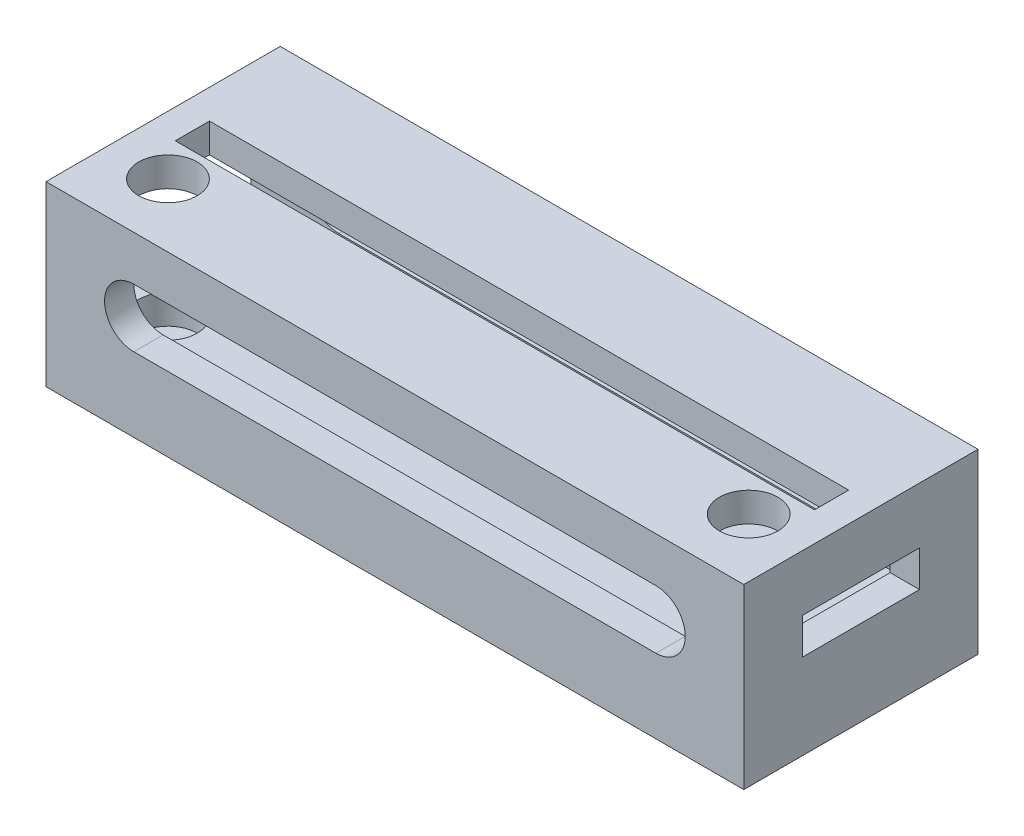
ISO-10303-21;
HEADER;
FILE_DESCRIPTION(('STEP AP214'),'2;1');
FILE_NAME('part.step','',(''),(''),'','','');
FILE_SCHEMA(('AUTOMOTIVE_DESIGN { 1 0 10303 214 1 1 1 1 }'));
ENDSEC;
DATA;
#1=APPLICATION_CONTEXT('core data for automotive mechanical design processes');
#2=APPLICATION_PROTOCOL_DEFINITION('international standard','automotive_design',2000,#1);
#3=PRODUCT_CONTEXT('',#1,'mechanical');
#4=PRODUCT('Part','Part','',(#3));
#5=PRODUCT_RELATED_PRODUCT_CATEGORY('part','',(#4));
#6=PRODUCT_DEFINITION_FORMATION('','',#4);
#7=PRODUCT_DEFINITION_CONTEXT('part definition',#1,'design');
#8=PRODUCT_DEFINITION('design','',#6,#7);
#9=PRODUCT_DEFINITION_SHAPE('','',#8);
#10=(LENGTH_UNIT() NAMED_UNIT(*) SI_UNIT(.MILLI.,.METRE.));
#11=(NAMED_UNIT(*) PLANE_ANGLE_UNIT() SI_UNIT($,.RADIAN.));
#12=(NAMED_UNIT(*) SI_UNIT($,.STERADIAN.) SOLID_ANGLE_UNIT());
#13=UNCERTAINTY_MEASURE_WITH_UNIT(LENGTH_MEASURE(1.E-05),#10,'distance_accuracy_value','');
#14=(GEOMETRIC_REPRESENTATION_CONTEXT(3) GLOBAL_UNCERTAINTY_ASSIGNED_CONTEXT((#13)) GLOBAL_UNIT_ASSIGNED_CONTEXT((#10,
#11,#12)) REPRESENTATION_CONTEXT('',''));
#15=CARTESIAN_POINT('',(0.,0.,0.));
#16=DIRECTION('',(0.,0.,1.));
#17=DIRECTION('',(1.,0.,0.));
#18=AXIS2_PLACEMENT_3D('',#15,#16,#17);
#19=CARTESIAN_POINT('',(0.,6.,0.));
#20=DIRECTION('',(0.,-1.,0.));
#21=DIRECTION('',(0.,0.,-1.));
#22=AXIS2_PLACEMENT_3D('',#19,#20,#21);
#23=PLANE('',#22);
#24=CARTESIAN_POINT('',(-29.75,6.,0.));
#25=DIRECTION('',(0.,-1.,0.));
#26=DIRECTION('',(0.,0.,-1.));
#27=AXIS2_PLACEMENT_3D('',#24,#25,#26);
#28=CIRCLE('',#27,3.);
#29=CARTESIAN_POINT('',(-29.75,6.,-3.));
#30=VERTEX_POINT('',#29);
#31=EDGE_CURVE('E235',#30,#30,#28,.T.);
#32=ORIENTED_EDGE('',*,*,#31,.T.);
#33=EDGE_LOOP('',(#32));
#34=FACE_BOUND('',#33,.T.);
#35=DIRECTION('',(0.,0.,-1.));
#36=VECTOR('',#35,1.);
#37=CARTESIAN_POINT('',(32.75,6.,4.5));
#38=LINE('',#37,#36);
#39=CARTESIAN_POINT('',(32.75,6.,3.5));
#40=VERTEX_POINT('',#39);
#41=CARTESIAN_POINT('',(32.75,6.,0.));
#42=VERTEX_POINT('',#41);
#43=EDGE_CURVE('E13',#40,#42,#38,.T.);
#44=ORIENTED_EDGE('',*,*,#43,.T.);
#45=CARTESIAN_POINT('',(29.75,6.,0.));
#46=DIRECTION('',(0.,-1.,0.));
#47=DIRECTION('',(0.,0.,-1.));
#48=AXIS2_PLACEMENT_3D('',#45,#46,#47);
#49=CIRCLE('',#48,3.);
#50=EDGE_CURVE('E53',#42,#42,#49,.T.);
#51=ORIENTED_EDGE('',*,*,#50,.T.);
#52=CARTESIAN_POINT('',(32.75,6.,-14.5));
#53=VERTEX_POINT('',#52);
#54=EDGE_CURVE('E47',#42,#53,#38,.T.);
#55=ORIENTED_EDGE('',*,*,#54,.T.);
#56=DIRECTION('',(1.,0.,0.));
#57=VECTOR('',#56,1.);
#58=CARTESIAN_POINT('',(32.75,6.,-14.5));
#59=LINE('',#58,#57);
#60=CARTESIAN_POINT('',(-35.75,6.,-14.5));
#61=VERTEX_POINT('',#60);
#62=EDGE_CURVE('E397',#61,#53,#59,.T.);
#63=ORIENTED_EDGE('',*,*,#62,.F.);
#64=DIRECTION('',(0.,0.,1.));
#65=VECTOR('',#64,1.);
#66=CARTESIAN_POINT('',(-35.75,6.,-14.5));
#67=LINE('',#66,#65);
#68=CARTESIAN_POINT('',(-35.75,6.,3.5));
#69=VERTEX_POINT('',#68);
#70=EDGE_CURVE('E267',#61,#69,#67,.T.);
#71=ORIENTED_EDGE('',*,*,#70,.T.);
#72=DIRECTION('',(-1.,0.,0.));
#73=VECTOR('',#72,1.);
#74=CARTESIAN_POINT('',(32.75,6.,3.5));
#75=LINE('',#74,#73);
#76=EDGE_CURVE('E387',#40,#69,#75,.T.);
#77=ORIENTED_EDGE('',*,*,#76,.F.);
#78=EDGE_LOOP('',(#44,#51,#55,#63,#71,#77));
#79=FACE_BOUND('',#78,.T.);
#80=ADVANCED_FACE('F38',(#34,#79),#23,.F.);
#81=CARTESIAN_POINT('',(0.,0.,0.));
#82=DIRECTION('',(0.,-1.,0.));
#83=DIRECTION('',(0.,0.,-1.));
#84=AXIS2_PLACEMENT_3D('',#81,#82,#83);
#85=PLANE('',#84);
#86=CARTESIAN_POINT('',(-29.75,0.,0.));
#87=DIRECTION('',(0.,1.,0.));
#88=DIRECTION('',(0.,0.,1.));
#89=AXIS2_PLACEMENT_3D('',#86,#87,#88);
#90=CIRCLE('',#89,0.99839537848789);
#91=CARTESIAN_POINT('',(-29.75,0.,0.99839537848789));
#92=VERTEX_POINT('',#91);
#93=EDGE_CURVE('E403',#92,#92,#90,.T.);
#94=ORIENTED_EDGE('',*,*,#93,.T.);
#95=EDGE_LOOP('',(#94));
#96=FACE_BOUND('',#95,.T.);
#97=DIRECTION('',(-1.,0.,0.));
#98=VECTOR('',#97,1.);
#99=CARTESIAN_POINT('',(32.75,0.,-17.5));
#100=LINE('',#99,#98);
#101=CARTESIAN_POINT('',(35.75,0.,-17.5));
#102=VERTEX_POINT('',#101);
#103=CARTESIAN_POINT('',(-35.75,0.,-17.5));
#104=VERTEX_POINT('',#103);
#105=EDGE_CURVE('E372',#102,#104,#100,.T.);
#106=ORIENTED_EDGE('',*,*,#105,.F.);
#107=DIRECTION('',(0.,0.,-1.));
#108=VECTOR('',#107,1.);
#109=CARTESIAN_POINT('',(35.75,0.,0.));
#110=LINE('',#109,#108);
#111=CARTESIAN_POINT('',(35.75,0.,6.5));
#112=VERTEX_POINT('',#111);
#113=EDGE_CURVE('E335',#112,#102,#110,.T.);
#114=ORIENTED_EDGE('',*,*,#113,.F.);
#115=DIRECTION('',(1.,0.,0.));
#116=VECTOR('',#115,1.);
#117=CARTESIAN_POINT('',(-32.75,0.,6.5));
#118=LINE('',#117,#116);
#119=CARTESIAN_POINT('',(-35.75,0.,6.5));
#120=VERTEX_POINT('',#119);
#121=EDGE_CURVE('E395',#120,#112,#118,.T.);
#122=ORIENTED_EDGE('',*,*,#121,.F.);
#123=DIRECTION('',(0.,0.,1.));
#124=VECTOR('',#123,1.);
#125=CARTESIAN_POINT('',(-35.75,0.,6.5));
#126=LINE('',#125,#124);
#127=EDGE_CURVE('E384',#104,#120,#126,.T.);
#128=ORIENTED_EDGE('',*,*,#127,.F.);
#129=EDGE_LOOP('',(#106,#114,#122,#128));
#130=FACE_BOUND('',#129,.T.);
#131=CARTESIAN_POINT('',(29.75,0.,0.));
#132=DIRECTION('',(0.,1.,0.));
#133=DIRECTION('',(0.,0.,1.));
#134=AXIS2_PLACEMENT_3D('',#131,#132,#133);
#135=CIRCLE('',#134,1.24311598076932);
#136=CARTESIAN_POINT('',(29.75,0.,1.24311598076932));
#137=VERTEX_POINT('',#136);
#138=EDGE_CURVE('E400',#137,#137,#135,.T.);
#139=ORIENTED_EDGE('',*,*,#138,.T.);
#140=EDGE_LOOP('',(#139));
#141=FACE_BOUND('',#140,.T.);
#142=ADVANCED_FACE('F40',(#96,#130,#141),#85,.T.);
#143=CARTESIAN_POINT('',(-29.75,6.,0.));
#144=DIRECTION('',(0.,-1.,0.));
#145=DIRECTION('',(0.,0.,-1.));
#146=AXIS2_PLACEMENT_3D('',#143,#144,#145);
#147=CYLINDRICAL_SURFACE('',#146,0.99839537848789);
#148=CARTESIAN_POINT('',(-29.75,3.,0.));
#149=DIRECTION('',(0.,-1.,0.));
#150=DIRECTION('',(0.,0.,-1.));
#151=AXIS2_PLACEMENT_3D('',#148,#149,#150);
#152=CIRCLE('',#151,0.99839537848789);
#153=CARTESIAN_POINT('',(-29.75,3.,-0.99839537848789));
#154=VERTEX_POINT('',#153);
#155=EDGE_CURVE('E42',#154,#154,#152,.T.);
#156=ORIENTED_EDGE('',*,*,#155,.F.);
#157=EDGE_LOOP('',(#156));
#158=FACE_BOUND('',#157,.T.);
#159=ORIENTED_EDGE('',*,*,#93,.F.);
#160=EDGE_LOOP('',(#159));
#161=FACE_BOUND('',#160,.T.);
#162=ADVANCED_FACE('F483',(#158,#161),#147,.F.);
#163=CARTESIAN_POINT('',(29.75,6.,0.));
#164=DIRECTION('',(0.,-1.,0.));
#165=DIRECTION('',(0.,0.,-1.));
#166=AXIS2_PLACEMENT_3D('',#163,#164,#165);
#167=CYLINDRICAL_SURFACE('',#166,1.24311598076932);
#168=CARTESIAN_POINT('',(29.75,3.,0.));
#169=DIRECTION('',(0.,-1.,0.));
#170=DIRECTION('',(0.,0.,-1.));
#171=AXIS2_PLACEMENT_3D('',#168,#169,#170);
#172=CIRCLE('',#171,1.24311598076932);
#173=CARTESIAN_POINT('',(29.75,3.,-1.24311598076932));
#174=VERTEX_POINT('',#173);
#175=EDGE_CURVE('E405',#174,#174,#172,.T.);
#176=ORIENTED_EDGE('',*,*,#175,.F.);
#177=EDGE_LOOP('',(#176));
#178=FACE_BOUND('',#177,.T.);
#179=ORIENTED_EDGE('',*,*,#138,.F.);
#180=EDGE_LOOP('',(#179));
#181=FACE_BOUND('',#180,.T.);
#182=ADVANCED_FACE('F489',(#178,#181),#167,.F.);
#183=CARTESIAN_POINT('',(0.,0.,6.5));
#184=DIRECTION('',(0.,0.,1.));
#185=DIRECTION('',(1.,0.,0.));
#186=AXIS2_PLACEMENT_3D('',#183,#184,#185);
#187=PLANE('',#186);
#188=CARTESIAN_POINT('',(-26.75,10.6,6.5));
#189=DIRECTION('',(0.,0.,1.));
#190=DIRECTION('',(1.,0.,0.));
#191=AXIS2_PLACEMENT_3D('',#188,#189,#190);
#192=CIRCLE('',#191,3.);
#193=CARTESIAN_POINT('',(-26.75,13.6,6.5));
#194=VERTEX_POINT('',#193);
#195=CARTESIAN_POINT('',(-26.75,7.6,6.5));
#196=VERTEX_POINT('',#195);
#197=EDGE_CURVE('E272',#194,#196,#192,.T.);
#198=ORIENTED_EDGE('',*,*,#197,.F.);
#199=DIRECTION('',(1.,0.,0.));
#200=VECTOR('',#199,1.);
#201=CARTESIAN_POINT('',(0.,13.6,6.5));
#202=LINE('',#201,#200);
#203=CARTESIAN_POINT('',(26.75,13.6,6.5));
#204=VERTEX_POINT('',#203);
#205=EDGE_CURVE('E277',#194,#204,#202,.T.);
#206=ORIENTED_EDGE('',*,*,#205,.T.);
#207=CARTESIAN_POINT('',(26.75,10.6,6.5));
#208=DIRECTION('',(0.,0.,1.));
#209=DIRECTION('',(1.,0.,0.));
#210=AXIS2_PLACEMENT_3D('',#207,#208,#209);
#211=CIRCLE('',#210,3.);
#212=CARTESIAN_POINT('',(26.75,7.6,6.5));
#213=VERTEX_POINT('',#212);
#214=EDGE_CURVE('E289',#213,#204,#211,.T.);
#215=ORIENTED_EDGE('',*,*,#214,.F.);
#216=DIRECTION('',(-1.,0.,0.));
#217=VECTOR('',#216,1.);
#218=CARTESIAN_POINT('',(0.,7.6,6.5));
#219=LINE('',#218,#217);
#220=EDGE_CURVE('E286',#213,#196,#219,.T.);
#221=ORIENTED_EDGE('',*,*,#220,.T.);
#222=EDGE_LOOP('',(#198,#206,#215,#221));
#223=FACE_BOUND('',#222,.T.);
#224=DIRECTION('',(0.,-1.,0.));
#225=VECTOR('',#224,1.);
#226=CARTESIAN_POINT('',(35.75,0.,6.5));
#227=LINE('',#226,#225);
#228=CARTESIAN_POINT('',(35.75,18.2,6.5));
#229=VERTEX_POINT('',#228);
#230=EDGE_CURVE('E331',#229,#112,#227,.T.);
#231=ORIENTED_EDGE('',*,*,#230,.F.);
#232=DIRECTION('',(1.,0.,0.));
#233=VECTOR('',#232,1.);
#234=CARTESIAN_POINT('',(-35.75,18.2,6.5));
#235=LINE('',#234,#233);
#236=CARTESIAN_POINT('',(-35.75,18.2,6.5));
#237=VERTEX_POINT('',#236);
#238=EDGE_CURVE('E253',#237,#229,#235,.T.);
#239=ORIENTED_EDGE('',*,*,#238,.F.);
#240=DIRECTION('',(0.,1.,0.));
#241=VECTOR('',#240,1.);
#242=CARTESIAN_POINT('',(-35.75,15.2,6.5));
#243=LINE('',#242,#241);
#244=EDGE_CURVE('E378',#120,#237,#243,.T.);
#245=ORIENTED_EDGE('',*,*,#244,.F.);
#246=ORIENTED_EDGE('',*,*,#121,.T.);
#247=EDGE_LOOP('',(#231,#239,#245,#246));
#248=FACE_BOUND('',#247,.T.);
#249=ADVANCED_FACE('F454',(#223,#248),#187,.T.);
#250=CARTESIAN_POINT('',(32.75,15.2,3.5));
#251=DIRECTION('',(0.,0.,1.));
#252=DIRECTION('',(1.,0.,0.));
#253=AXIS2_PLACEMENT_3D('',#250,#251,#252);
#254=PLANE('',#253);
#255=DIRECTION('',(1.,0.,0.));
#256=VECTOR('',#255,1.);
#257=CARTESIAN_POINT('',(32.75,13.6,3.5));
#258=LINE('',#257,#256);
#259=CARTESIAN_POINT('',(-26.75,13.6,3.5));
#260=VERTEX_POINT('',#259);
#261=CARTESIAN_POINT('',(26.75,13.6,3.5));
#262=VERTEX_POINT('',#261);
#263=EDGE_CURVE('E320',#260,#262,#258,.T.);
#264=ORIENTED_EDGE('',*,*,#263,.F.);
#265=CARTESIAN_POINT('',(-26.75,10.6,3.5));
#266=DIRECTION('',(0.,0.,1.));
#267=DIRECTION('',(1.,0.,0.));
#268=AXIS2_PLACEMENT_3D('',#265,#266,#267);
#269=CIRCLE('',#268,3.);
#270=CARTESIAN_POINT('',(-26.75,7.6,3.5));
#271=VERTEX_POINT('',#270);
#272=EDGE_CURVE('E325',#260,#271,#269,.T.);
#273=ORIENTED_EDGE('',*,*,#272,.T.);
#274=DIRECTION('',(-1.,0.,0.));
#275=VECTOR('',#274,1.);
#276=CARTESIAN_POINT('',(32.75,7.6,3.5));
#277=LINE('',#276,#275);
#278=CARTESIAN_POINT('',(26.75,7.6,3.5));
#279=VERTEX_POINT('',#278);
#280=EDGE_CURVE('E310',#279,#271,#277,.T.);
#281=ORIENTED_EDGE('',*,*,#280,.F.);
#282=CARTESIAN_POINT('',(26.75,10.6,3.5));
#283=DIRECTION('',(0.,0.,1.));
#284=DIRECTION('',(1.,0.,0.));
#285=AXIS2_PLACEMENT_3D('',#282,#283,#284);
#286=CIRCLE('',#285,3.);
#287=EDGE_CURVE('E315',#279,#262,#286,.T.);
#288=ORIENTED_EDGE('',*,*,#287,.T.);
#289=EDGE_LOOP('',(#264,#273,#281,#288));
#290=FACE_BOUND('',#289,.T.);
#291=ORIENTED_EDGE('',*,*,#76,.T.);
#292=DIRECTION('',(0.,1.,0.));
#293=VECTOR('',#292,1.);
#294=CARTESIAN_POINT('',(-35.75,15.2,3.5));
#295=LINE('',#294,#293);
#296=CARTESIAN_POINT('',(-35.75,15.2,3.5));
#297=VERTEX_POINT('',#296);
#298=EDGE_CURVE('E270',#69,#297,#295,.T.);
#299=ORIENTED_EDGE('',*,*,#298,.T.);
#300=DIRECTION('',(-1.,0.,0.));
#301=VECTOR('',#300,1.);
#302=CARTESIAN_POINT('',(32.75,15.2,3.5));
#303=LINE('',#302,#301);
#304=CARTESIAN_POINT('',(32.75,15.2,3.5));
#305=VERTEX_POINT('',#304);
#306=EDGE_CURVE('E388',#305,#297,#303,.T.);
#307=ORIENTED_EDGE('',*,*,#306,.F.);
#308=DIRECTION('',(0.,-1.,0.));
#309=VECTOR('',#308,1.);
#310=CARTESIAN_POINT('',(32.75,15.2,3.5));
#311=LINE('',#310,#309);
#312=EDGE_CURVE('E391',#305,#40,#311,.T.);
#313=ORIENTED_EDGE('',*,*,#312,.T.);
#314=EDGE_LOOP('',(#291,#299,#307,#313));
#315=FACE_BOUND('',#314,.T.);
#316=ADVANCED_FACE('F496',(#290,#315),#254,.F.);
#317=CARTESIAN_POINT('',(-35.75,0.,0.));
#318=DIRECTION('',(1.,0.,0.));
#319=DIRECTION('',(0.,0.,-1.));
#320=AXIS2_PLACEMENT_3D('',#317,#318,#319);
#321=PLANE('',#320);
#322=DIRECTION('',(0.,0.,1.));
#323=VECTOR('',#322,1.);
#324=CARTESIAN_POINT('',(-35.75,18.2,-17.5));
#325=LINE('',#324,#323);
#326=CARTESIAN_POINT('',(-35.75,18.2,-17.5));
#327=VERTEX_POINT('',#326);
#328=EDGE_CURVE('E250',#327,#237,#325,.T.);
#329=ORIENTED_EDGE('',*,*,#328,.F.);
#330=DIRECTION('',(0.,1.,0.));
#331=VECTOR('',#330,1.);
#332=CARTESIAN_POINT('',(-35.75,15.2,-17.5));
#333=LINE('',#332,#331);
#334=EDGE_CURVE('E375',#104,#327,#333,.T.);
#335=ORIENTED_EDGE('',*,*,#334,.F.);
#336=ORIENTED_EDGE('',*,*,#127,.T.);
#337=ORIENTED_EDGE('',*,*,#244,.T.);
#338=EDGE_LOOP('',(#329,#335,#336,#337));
#339=FACE_BOUND('',#338,.T.);
#340=ORIENTED_EDGE('',*,*,#70,.F.);
#341=DIRECTION('',(0.,-1.,0.));
#342=VECTOR('',#341,1.);
#343=CARTESIAN_POINT('',(-35.75,15.2,-14.5));
#344=LINE('',#343,#342);
#345=CARTESIAN_POINT('',(-35.75,15.2,-14.5));
#346=VERTEX_POINT('',#345);
#347=EDGE_CURVE('E262',#346,#61,#344,.T.);
#348=ORIENTED_EDGE('',*,*,#347,.F.);
#349=DIRECTION('',(0.,0.,1.));
#350=VECTOR('',#349,1.);
#351=CARTESIAN_POINT('',(-35.75,15.2,-17.5));
#352=LINE('',#351,#350);
#353=EDGE_CURVE('E246',#346,#297,#352,.T.);
#354=ORIENTED_EDGE('',*,*,#353,.T.);
#355=ORIENTED_EDGE('',*,*,#298,.F.);
#356=EDGE_LOOP('',(#340,#348,#354,#355));
#357=FACE_BOUND('',#356,.T.);
#358=ADVANCED_FACE('F450',(#339,#357),#321,.F.);
#359=CARTESIAN_POINT('',(0.,0.,-14.5));
#360=DIRECTION('',(0.,0.,-1.));
#361=DIRECTION('',(-1.,0.,0.));
#362=AXIS2_PLACEMENT_3D('',#359,#360,#361);
#363=PLANE('',#362);
#364=DIRECTION('',(1.,0.,0.));
#365=VECTOR('',#364,1.);
#366=CARTESIAN_POINT('',(0.,7.6,-14.5));
#367=LINE('',#366,#365);
#368=CARTESIAN_POINT('',(-26.75,7.6,-14.5));
#369=VERTEX_POINT('',#368);
#370=CARTESIAN_POINT('',(26.75,7.6,-14.5));
#371=VERTEX_POINT('',#370);
#372=EDGE_CURVE('E297',#369,#371,#367,.T.);
#373=ORIENTED_EDGE('',*,*,#372,.F.);
#374=CARTESIAN_POINT('',(-26.75,10.6,-14.5));
#375=DIRECTION('',(0.,0.,-1.));
#376=DIRECTION('',(-1.,0.,0.));
#377=AXIS2_PLACEMENT_3D('',#374,#375,#376);
#378=CIRCLE('',#377,3.);
#379=CARTESIAN_POINT('',(-26.75,13.6,-14.5));
#380=VERTEX_POINT('',#379);
#381=EDGE_CURVE('E322',#369,#380,#378,.T.);
#382=ORIENTED_EDGE('',*,*,#381,.T.);
#383=DIRECTION('',(-1.,0.,0.));
#384=VECTOR('',#383,1.);
#385=CARTESIAN_POINT('',(0.,13.6,-14.5));
#386=LINE('',#385,#384);
#387=CARTESIAN_POINT('',(26.75,13.6,-14.5));
#388=VERTEX_POINT('',#387);
#389=EDGE_CURVE('E318',#388,#380,#386,.T.);
#390=ORIENTED_EDGE('',*,*,#389,.F.);
#391=CARTESIAN_POINT('',(26.75,10.6,-14.5));
#392=DIRECTION('',(0.,0.,-1.));
#393=DIRECTION('',(-1.,0.,0.));
#394=AXIS2_PLACEMENT_3D('',#391,#392,#393);
#395=CIRCLE('',#394,3.);
#396=EDGE_CURVE('E312',#388,#371,#395,.T.);
#397=ORIENTED_EDGE('',*,*,#396,.T.);
#398=EDGE_LOOP('',(#373,#382,#390,#397));
#399=FACE_BOUND('',#398,.T.);
#400=DIRECTION('',(1.,0.,0.));
#401=VECTOR('',#400,1.);
#402=CARTESIAN_POINT('',(32.75,15.2,-14.5));
#403=LINE('',#402,#401);
#404=CARTESIAN_POINT('',(32.75,15.2,-14.5));
#405=VERTEX_POINT('',#404);
#406=EDGE_CURVE('E376',#346,#405,#403,.T.);
#407=ORIENTED_EDGE('',*,*,#406,.F.);
#408=ORIENTED_EDGE('',*,*,#347,.T.);
#409=ORIENTED_EDGE('',*,*,#62,.T.);
#410=DIRECTION('',(0.,-1.,0.));
#411=VECTOR('',#410,1.);
#412=CARTESIAN_POINT('',(32.75,15.2,-14.5));
#413=LINE('',#412,#411);
#414=EDGE_CURVE('E371',#405,#53,#413,.T.);
#415=ORIENTED_EDGE('',*,*,#414,.F.);
#416=EDGE_LOOP('',(#407,#408,#409,#415));
#417=FACE_BOUND('',#416,.T.);
#418=ADVANCED_FACE('F466',(#399,#417),#363,.F.);
#419=CARTESIAN_POINT('',(0.,0.,-17.5));
#420=DIRECTION('',(0.,0.,-1.));
#421=DIRECTION('',(-1.,0.,0.));
#422=AXIS2_PLACEMENT_3D('',#419,#420,#421);
#423=PLANE('',#422);
#424=CARTESIAN_POINT('',(-26.75,10.6,-17.5));
#425=DIRECTION('',(0.,0.,1.));
#426=DIRECTION('',(1.,0.,0.));
#427=AXIS2_PLACEMENT_3D('',#424,#425,#426);
#428=CIRCLE('',#427,3.);
#429=CARTESIAN_POINT('',(-26.75,13.6,-17.5));
#430=VERTEX_POINT('',#429);
#431=CARTESIAN_POINT('',(-26.75,7.6,-17.5));
#432=VERTEX_POINT('',#431);
#433=EDGE_CURVE('E273',#430,#432,#428,.T.);
#434=ORIENTED_EDGE('',*,*,#433,.T.);
#435=DIRECTION('',(-1.,0.,0.));
#436=VECTOR('',#435,1.);
#437=CARTESIAN_POINT('',(0.,7.6,-17.5));
#438=LINE('',#437,#436);
#439=CARTESIAN_POINT('',(26.75,7.6,-17.5));
#440=VERTEX_POINT('',#439);
#441=EDGE_CURVE('E276',#440,#432,#438,.T.);
#442=ORIENTED_EDGE('',*,*,#441,.F.);
#443=CARTESIAN_POINT('',(26.75,10.6,-17.5));
#444=DIRECTION('',(0.,0.,1.));
#445=DIRECTION('',(1.,0.,0.));
#446=AXIS2_PLACEMENT_3D('',#443,#444,#445);
#447=CIRCLE('',#446,3.);
#448=CARTESIAN_POINT('',(26.75,13.6,-17.5));
#449=VERTEX_POINT('',#448);
#450=EDGE_CURVE('E279',#440,#449,#447,.T.);
#451=ORIENTED_EDGE('',*,*,#450,.T.);
#452=DIRECTION('',(1.,0.,0.));
#453=VECTOR('',#452,1.);
#454=CARTESIAN_POINT('',(0.,13.6,-17.5));
#455=LINE('',#454,#453);
#456=EDGE_CURVE('E282',#430,#449,#455,.T.);
#457=ORIENTED_EDGE('',*,*,#456,.F.);
#458=EDGE_LOOP('',(#434,#442,#451,#457));
#459=FACE_BOUND('',#458,.T.);
#460=ORIENTED_EDGE('',*,*,#334,.T.);
#461=DIRECTION('',(-1.,0.,0.));
#462=VECTOR('',#461,1.);
#463=CARTESIAN_POINT('',(-35.75,18.2,-17.5));
#464=LINE('',#463,#462);
#465=CARTESIAN_POINT('',(35.75,18.2,-17.5));
#466=VERTEX_POINT('',#465);
#467=EDGE_CURVE('E259',#466,#327,#464,.T.);
#468=ORIENTED_EDGE('',*,*,#467,.F.);
#469=DIRECTION('',(0.,1.,0.));
#470=VECTOR('',#469,1.);
#471=CARTESIAN_POINT('',(35.75,0.,-17.5));
#472=LINE('',#471,#470);
#473=EDGE_CURVE('E329',#102,#466,#472,.T.);
#474=ORIENTED_EDGE('',*,*,#473,.F.);
#475=ORIENTED_EDGE('',*,*,#105,.T.);
#476=EDGE_LOOP('',(#460,#468,#474,#475));
#477=FACE_BOUND('',#476,.T.);
#478=ADVANCED_FACE('F463',(#459,#477),#423,.T.);
#479=CARTESIAN_POINT('',(32.75,0.,0.));
#480=DIRECTION('',(1.,0.,0.));
#481=DIRECTION('',(0.,0.,-1.));
#482=AXIS2_PLACEMENT_3D('',#479,#480,#481);
#483=PLANE('',#482);
#484=DIRECTION('',(0.,-1.,0.));
#485=VECTOR('',#484,1.);
#486=CARTESIAN_POINT('',(32.75,0.,0.499999999999996));
#487=LINE('',#486,#485);
#488=CARTESIAN_POINT('',(32.75,12.45,0.499999999999997));
#489=VERTEX_POINT('',#488);
#490=CARTESIAN_POINT('',(32.75,8.75,0.499999999999997));
#491=VERTEX_POINT('',#490);
#492=EDGE_CURVE('E332',#489,#491,#487,.T.);
#493=ORIENTED_EDGE('',*,*,#492,.T.);
#494=DIRECTION('',(0.,0.,1.));
#495=VECTOR('',#494,1.);
#496=CARTESIAN_POINT('',(32.75,8.75,0.));
#497=LINE('',#496,#495);
#498=CARTESIAN_POINT('',(32.75,8.75,-11.5));
#499=VERTEX_POINT('',#498);
#500=EDGE_CURVE('E357',#499,#491,#497,.T.);
#501=ORIENTED_EDGE('',*,*,#500,.F.);
#502=DIRECTION('',(0.,-1.,0.));
#503=VECTOR('',#502,1.);
#504=CARTESIAN_POINT('',(32.75,0.,-11.5));
#505=LINE('',#504,#503);
#506=CARTESIAN_POINT('',(32.75,12.45,-11.5));
#507=VERTEX_POINT('',#506);
#508=EDGE_CURVE('E355',#507,#499,#505,.T.);
#509=ORIENTED_EDGE('',*,*,#508,.F.);
#510=DIRECTION('',(0.,0.,-1.));
#511=VECTOR('',#510,1.);
#512=CARTESIAN_POINT('',(32.75,12.45,0.));
#513=LINE('',#512,#511);
#514=EDGE_CURVE('E352',#489,#507,#513,.T.);
#515=ORIENTED_EDGE('',*,*,#514,.F.);
#516=EDGE_LOOP('',(#493,#501,#509,#515));
#517=FACE_BOUND('',#516,.T.);
#518=ORIENTED_EDGE('',*,*,#54,.F.);
#519=ORIENTED_EDGE('',*,*,#43,.F.);
#520=ORIENTED_EDGE('',*,*,#312,.F.);
#521=DIRECTION('',(0.,0.,-1.));
#522=VECTOR('',#521,1.);
#523=CARTESIAN_POINT('',(32.75,15.2,0.));
#524=LINE('',#523,#522);
#525=CARTESIAN_POINT('',(32.75,15.2,0.));
#526=VERTEX_POINT('',#525);
#527=EDGE_CURVE('E349',#305,#526,#524,.T.);
#528=ORIENTED_EDGE('',*,*,#527,.T.);
#529=CARTESIAN_POINT('',(32.75,15.2,-3.75));
#530=VERTEX_POINT('',#529);
#531=EDGE_CURVE('E353',#526,#530,#524,.T.);
#532=ORIENTED_EDGE('',*,*,#531,.T.);
#533=DIRECTION('',(0.,1.,0.));
#534=VECTOR('',#533,1.);
#535=CARTESIAN_POINT('',(32.75,15.2,-3.75));
#536=LINE('',#535,#534);
#537=CARTESIAN_POINT('',(32.75,18.2,-3.75));
#538=VERTEX_POINT('',#537);
#539=EDGE_CURVE('E216',#530,#538,#536,.T.);
#540=ORIENTED_EDGE('',*,*,#539,.T.);
#541=DIRECTION('',(0.,0.,-1.));
#542=VECTOR('',#541,1.);
#543=CARTESIAN_POINT('',(32.75,18.2,-7.25));
#544=LINE('',#543,#542);
#545=CARTESIAN_POINT('',(32.75,18.2,-7.25));
#546=VERTEX_POINT('',#545);
#547=EDGE_CURVE('E232',#538,#546,#544,.T.);
#548=ORIENTED_EDGE('',*,*,#547,.T.);
#549=DIRECTION('',(0.,1.,0.));
#550=VECTOR('',#549,1.);
#551=CARTESIAN_POINT('',(32.75,15.2,-7.25));
#552=LINE('',#551,#550);
#553=CARTESIAN_POINT('',(32.75,15.2,-7.25));
#554=VERTEX_POINT('',#553);
#555=EDGE_CURVE('E247',#554,#546,#552,.T.);
#556=ORIENTED_EDGE('',*,*,#555,.F.);
#557=EDGE_CURVE('E328',#554,#405,#524,.T.);
#558=ORIENTED_EDGE('',*,*,#557,.T.);
#559=ORIENTED_EDGE('',*,*,#414,.T.);
#560=EDGE_LOOP('',(#518,#519,#520,#528,#532,#540,#548,#556,#558,#559));
#561=FACE_BOUND('',#560,.T.);
#562=ADVANCED_FACE('F465',(#517,#561),#483,.F.);
#563=CARTESIAN_POINT('',(35.75,12.45,0.));
#564=DIRECTION('',(0.,1.,0.));
#565=DIRECTION('',(0.,0.,1.));
#566=AXIS2_PLACEMENT_3D('',#563,#564,#565);
#567=PLANE('',#566);
#568=ORIENTED_EDGE('',*,*,#514,.T.);
#569=DIRECTION('',(-1.,0.,0.));
#570=VECTOR('',#569,1.);
#571=CARTESIAN_POINT('',(35.75,12.45,-11.5));
#572=LINE('',#571,#570);
#573=CARTESIAN_POINT('',(35.75,12.45,-11.5));
#574=VERTEX_POINT('',#573);
#575=EDGE_CURVE('E368',#574,#507,#572,.T.);
#576=ORIENTED_EDGE('',*,*,#575,.F.);
#577=DIRECTION('',(0.,0.,-1.));
#578=VECTOR('',#577,1.);
#579=CARTESIAN_POINT('',(35.75,12.45,0.));
#580=LINE('',#579,#578);
#581=CARTESIAN_POINT('',(35.75,12.45,0.499999999999997));
#582=VERTEX_POINT('',#581);
#583=EDGE_CURVE('E338',#582,#574,#580,.T.);
#584=ORIENTED_EDGE('',*,*,#583,.F.);
#585=DIRECTION('',(-1.,0.,0.));
#586=VECTOR('',#585,1.);
#587=CARTESIAN_POINT('',(35.75,12.45,0.499999999999997));
#588=LINE('',#587,#586);
#589=EDGE_CURVE('E348',#582,#489,#588,.T.);
#590=ORIENTED_EDGE('',*,*,#589,.T.);
#591=EDGE_LOOP('',(#568,#576,#584,#590));
#592=FACE_BOUND('',#591,.T.);
#593=ADVANCED_FACE('F473',(#592),#567,.F.);
#594=CARTESIAN_POINT('',(35.75,0.,-11.5));
#595=DIRECTION('',(0.,0.,-1.));
#596=DIRECTION('',(-1.,0.,0.));
#597=AXIS2_PLACEMENT_3D('',#594,#595,#596);
#598=PLANE('',#597);
#599=ORIENTED_EDGE('',*,*,#508,.T.);
#600=DIRECTION('',(-1.,0.,0.));
#601=VECTOR('',#600,1.);
#602=CARTESIAN_POINT('',(35.75,8.75,-11.5));
#603=LINE('',#602,#601);
#604=CARTESIAN_POINT('',(35.75,8.75,-11.5));
#605=VERTEX_POINT('',#604);
#606=EDGE_CURVE('E365',#605,#499,#603,.T.);
#607=ORIENTED_EDGE('',*,*,#606,.F.);
#608=DIRECTION('',(0.,-1.,0.));
#609=VECTOR('',#608,1.);
#610=CARTESIAN_POINT('',(35.75,0.,-11.5));
#611=LINE('',#610,#609);
#612=EDGE_CURVE('E341',#574,#605,#611,.T.);
#613=ORIENTED_EDGE('',*,*,#612,.F.);
#614=ORIENTED_EDGE('',*,*,#575,.T.);
#615=EDGE_LOOP('',(#599,#607,#613,#614));
#616=FACE_BOUND('',#615,.T.);
#617=ADVANCED_FACE('F598',(#616),#598,.F.);
#618=CARTESIAN_POINT('',(35.75,8.75,0.));
#619=DIRECTION('',(0.,-1.,0.));
#620=DIRECTION('',(0.,0.,-1.));
#621=AXIS2_PLACEMENT_3D('',#618,#619,#620);
#622=PLANE('',#621);
#623=ORIENTED_EDGE('',*,*,#500,.T.);
#624=DIRECTION('',(-1.,0.,0.));
#625=VECTOR('',#624,1.);
#626=CARTESIAN_POINT('',(35.75,8.75,0.499999999999997));
#627=LINE('',#626,#625);
#628=CARTESIAN_POINT('',(35.75,8.75,0.499999999999997));
#629=VERTEX_POINT('',#628);
#630=EDGE_CURVE('E362',#629,#491,#627,.T.);
#631=ORIENTED_EDGE('',*,*,#630,.F.);
#632=DIRECTION('',(0.,0.,1.));
#633=VECTOR('',#632,1.);
#634=CARTESIAN_POINT('',(35.75,8.75,0.));
#635=LINE('',#634,#633);
#636=EDGE_CURVE('E343',#605,#629,#635,.T.);
#637=ORIENTED_EDGE('',*,*,#636,.F.);
#638=ORIENTED_EDGE('',*,*,#606,.T.);
#639=EDGE_LOOP('',(#623,#631,#637,#638));
#640=FACE_BOUND('',#639,.T.);
#641=ADVANCED_FACE('F605',(#640),#622,.F.);
#642=CARTESIAN_POINT('',(35.75,0.,0.499999999999996));
#643=DIRECTION('',(0.,0.,-1.));
#644=DIRECTION('',(0.,1.,0.));
#645=AXIS2_PLACEMENT_3D('',#642,#643,#644);
#646=PLANE('',#645);
#647=ORIENTED_EDGE('',*,*,#492,.F.);
#648=ORIENTED_EDGE('',*,*,#589,.F.);
#649=DIRECTION('',(0.,-1.,0.));
#650=VECTOR('',#649,1.);
#651=CARTESIAN_POINT('',(35.75,0.,0.499999999999996));
#652=LINE('',#651,#650);
#653=EDGE_CURVE('E345',#582,#629,#652,.T.);
#654=ORIENTED_EDGE('',*,*,#653,.T.);
#655=ORIENTED_EDGE('',*,*,#630,.T.);
#656=EDGE_LOOP('',(#647,#648,#654,#655));
#657=FACE_BOUND('',#656,.T.);
#658=ADVANCED_FACE('F528',(#657),#646,.T.);
#659=CARTESIAN_POINT('',(35.75,0.,0.));
#660=DIRECTION('',(1.,0.,0.));
#661=DIRECTION('',(0.,0.,-1.));
#662=AXIS2_PLACEMENT_3D('',#659,#660,#661);
#663=PLANE('',#662);
#664=ORIENTED_EDGE('',*,*,#473,.T.);
#665=DIRECTION('',(0.,0.,-1.));
#666=VECTOR('',#665,1.);
#667=CARTESIAN_POINT('',(35.75,18.2,-17.5));
#668=LINE('',#667,#666);
#669=EDGE_CURVE('E256',#229,#466,#668,.T.);
#670=ORIENTED_EDGE('',*,*,#669,.F.);
#671=ORIENTED_EDGE('',*,*,#230,.T.);
#672=ORIENTED_EDGE('',*,*,#113,.T.);
#673=EDGE_LOOP('',(#664,#670,#671,#672));
#674=FACE_BOUND('',#673,.T.);
#675=ORIENTED_EDGE('',*,*,#583,.T.);
#676=ORIENTED_EDGE('',*,*,#612,.T.);
#677=ORIENTED_EDGE('',*,*,#636,.T.);
#678=ORIENTED_EDGE('',*,*,#653,.F.);
#679=EDGE_LOOP('',(#675,#676,#677,#678));
#680=FACE_BOUND('',#679,.T.);
#681=ADVANCED_FACE('F457',(#674,#680),#663,.T.);
#682=CARTESIAN_POINT('',(0.,7.6,-17.5));
#683=DIRECTION('',(0.,1.,0.));
#684=DIRECTION('',(-1.,0.,0.));
#685=AXIS2_PLACEMENT_3D('',#682,#683,#684);
#686=PLANE('',#685);
#687=ORIENTED_EDGE('',*,*,#372,.T.);
#688=DIRECTION('',(0.,0.,1.));
#689=VECTOR('',#688,1.);
#690=CARTESIAN_POINT('',(26.75,7.6,-17.5));
#691=LINE('',#690,#689);
#692=EDGE_CURVE('E303',#440,#371,#691,.T.);
#693=ORIENTED_EDGE('',*,*,#692,.F.);
#694=ORIENTED_EDGE('',*,*,#441,.T.);
#695=DIRECTION('',(0.,0.,1.));
#696=VECTOR('',#695,1.);
#697=CARTESIAN_POINT('',(-26.75,7.6,-17.5));
#698=LINE('',#697,#696);
#699=EDGE_CURVE('E307',#432,#369,#698,.T.);
#700=ORIENTED_EDGE('',*,*,#699,.T.);
#701=EDGE_LOOP('',(#687,#693,#694,#700));
#702=FACE_BOUND('',#701,.T.);
#703=ADVANCED_FACE('F527',(#702),#686,.T.);
#704=CARTESIAN_POINT('',(26.75,10.6,-17.5));
#705=DIRECTION('',(0.,0.,1.));
#706=DIRECTION('',(1.,0.,0.));
#707=AXIS2_PLACEMENT_3D('',#704,#705,#706);
#708=CYLINDRICAL_SURFACE('',#707,3.);
#709=DIRECTION('',(0.,0.,1.));
#710=VECTOR('',#709,1.);
#711=CARTESIAN_POINT('',(26.75,13.6,-17.5));
#712=LINE('',#711,#710);
#713=EDGE_CURVE('E299',#449,#388,#712,.T.);
#714=ORIENTED_EDGE('',*,*,#713,.F.);
#715=ORIENTED_EDGE('',*,*,#450,.F.);
#716=ORIENTED_EDGE('',*,*,#692,.T.);
#717=ORIENTED_EDGE('',*,*,#396,.F.);
#718=EDGE_LOOP('',(#714,#715,#716,#717));
#719=FACE_BOUND('',#718,.T.);
#720=ADVANCED_FACE('F694',(#719),#708,.F.);
#721=CARTESIAN_POINT('',(0.,13.6,-17.5));
#722=DIRECTION('',(0.,-1.,0.));
#723=DIRECTION('',(1.,0.,0.));
#724=AXIS2_PLACEMENT_3D('',#721,#722,#723);
#725=PLANE('',#724);
#726=ORIENTED_EDGE('',*,*,#389,.T.);
#727=DIRECTION('',(0.,0.,1.));
#728=VECTOR('',#727,1.);
#729=CARTESIAN_POINT('',(-26.75,13.6,-17.5));
#730=LINE('',#729,#728);
#731=EDGE_CURVE('E294',#430,#380,#730,.T.);
#732=ORIENTED_EDGE('',*,*,#731,.F.);
#733=ORIENTED_EDGE('',*,*,#456,.T.);
#734=ORIENTED_EDGE('',*,*,#713,.T.);
#735=EDGE_LOOP('',(#726,#732,#733,#734));
#736=FACE_BOUND('',#735,.T.);
#737=ADVANCED_FACE('F690',(#736),#725,.T.);
#738=CARTESIAN_POINT('',(-26.75,10.6,-17.5));
#739=DIRECTION('',(0.,0.,1.));
#740=DIRECTION('',(1.,0.,0.));
#741=AXIS2_PLACEMENT_3D('',#738,#739,#740);
#742=CYLINDRICAL_SURFACE('',#741,3.);
#743=ORIENTED_EDGE('',*,*,#699,.F.);
#744=ORIENTED_EDGE('',*,*,#433,.F.);
#745=ORIENTED_EDGE('',*,*,#731,.T.);
#746=ORIENTED_EDGE('',*,*,#381,.F.);
#747=EDGE_LOOP('',(#743,#744,#745,#746));
#748=FACE_BOUND('',#747,.T.);
#749=ADVANCED_FACE('F698',(#748),#742,.F.);
#750=EDGE_CURVE('E298',#260,#194,#730,.T.);
#751=ORIENTED_EDGE('',*,*,#750,.T.);
#752=ORIENTED_EDGE('',*,*,#197,.T.);
#753=EDGE_CURVE('E284',#271,#196,#698,.T.);
#754=ORIENTED_EDGE('',*,*,#753,.F.);
#755=ORIENTED_EDGE('',*,*,#272,.F.);
#756=EDGE_LOOP('',(#751,#752,#754,#755));
#757=FACE_BOUND('',#756,.T.);
#758=ADVANCED_FACE('F688',(#757),#742,.F.);
#759=ORIENTED_EDGE('',*,*,#263,.T.);
#760=EDGE_CURVE('E302',#262,#204,#712,.T.);
#761=ORIENTED_EDGE('',*,*,#760,.T.);
#762=ORIENTED_EDGE('',*,*,#205,.F.);
#763=ORIENTED_EDGE('',*,*,#750,.F.);
#764=EDGE_LOOP('',(#759,#761,#762,#763));
#765=FACE_BOUND('',#764,.T.);
#766=ADVANCED_FACE('F684',(#765),#725,.T.);
#767=EDGE_CURVE('E306',#279,#213,#691,.T.);
#768=ORIENTED_EDGE('',*,*,#767,.T.);
#769=ORIENTED_EDGE('',*,*,#214,.T.);
#770=ORIENTED_EDGE('',*,*,#760,.F.);
#771=ORIENTED_EDGE('',*,*,#287,.F.);
#772=EDGE_LOOP('',(#768,#769,#770,#771));
#773=FACE_BOUND('',#772,.T.);
#774=ADVANCED_FACE('F687',(#773),#708,.F.);
#775=ORIENTED_EDGE('',*,*,#280,.T.);
#776=ORIENTED_EDGE('',*,*,#753,.T.);
#777=ORIENTED_EDGE('',*,*,#220,.F.);
#778=ORIENTED_EDGE('',*,*,#767,.F.);
#779=EDGE_LOOP('',(#775,#776,#777,#778));
#780=FACE_BOUND('',#779,.T.);
#781=ADVANCED_FACE('F620',(#780),#686,.T.);
#782=CARTESIAN_POINT('',(0.,15.2,0.));
#783=DIRECTION('',(0.,1.,0.));
#784=DIRECTION('',(0.,0.,1.));
#785=AXIS2_PLACEMENT_3D('',#782,#783,#784);
#786=PLANE('',#785);
#787=CARTESIAN_POINT('',(-29.75,15.2,0.));
#788=DIRECTION('',(0.,1.,0.));
#789=DIRECTION('',(0.,0.,1.));
#790=AXIS2_PLACEMENT_3D('',#787,#788,#789);
#791=CIRCLE('',#790,3.);
#792=CARTESIAN_POINT('',(-29.75,15.2,3.));
#793=VERTEX_POINT('',#792);
#794=EDGE_CURVE('E411',#793,#793,#791,.T.);
#795=ORIENTED_EDGE('',*,*,#794,.T.);
#796=EDGE_LOOP('',(#795));
#797=FACE_BOUND('',#796,.T.);
#798=ORIENTED_EDGE('',*,*,#531,.F.);
#799=CARTESIAN_POINT('',(29.75,15.2,0.));
#800=DIRECTION('',(0.,1.,0.));
#801=DIRECTION('',(0.,0.,1.));
#802=AXIS2_PLACEMENT_3D('',#799,#800,#801);
#803=CIRCLE('',#802,3.);
#804=EDGE_CURVE('E58',#526,#526,#803,.T.);
#805=ORIENTED_EDGE('',*,*,#804,.T.);
#806=ORIENTED_EDGE('',*,*,#527,.F.);
#807=ORIENTED_EDGE('',*,*,#306,.T.);
#808=ORIENTED_EDGE('',*,*,#353,.F.);
#809=ORIENTED_EDGE('',*,*,#406,.T.);
#810=ORIENTED_EDGE('',*,*,#557,.F.);
#811=DIRECTION('',(-1.,0.,0.));
#812=VECTOR('',#811,1.);
#813=CARTESIAN_POINT('',(-32.75,15.2,-7.25));
#814=LINE('',#813,#812);
#815=CARTESIAN_POINT('',(-32.75,15.2,-7.25));
#816=VERTEX_POINT('',#815);
#817=EDGE_CURVE('E217',#554,#816,#814,.T.);
#818=ORIENTED_EDGE('',*,*,#817,.T.);
#819=DIRECTION('',(0.,0.,1.));
#820=VECTOR('',#819,1.);
#821=CARTESIAN_POINT('',(-32.75,15.2,-7.25));
#822=LINE('',#821,#820);
#823=CARTESIAN_POINT('',(-32.75,15.2,-3.75));
#824=VERTEX_POINT('',#823);
#825=EDGE_CURVE('E209',#816,#824,#822,.T.);
#826=ORIENTED_EDGE('',*,*,#825,.T.);
#827=DIRECTION('',(1.,0.,0.));
#828=VECTOR('',#827,1.);
#829=CARTESIAN_POINT('',(-32.75,15.2,-3.75));
#830=LINE('',#829,#828);
#831=EDGE_CURVE('E221',#824,#530,#830,.T.);
#832=ORIENTED_EDGE('',*,*,#831,.T.);
#833=EDGE_LOOP('',(#798,#805,#806,#807,#808,#809,#810,#818,#826,#832));
#834=FACE_BOUND('',#833,.T.);
#835=ADVANCED_FACE('F226',(#797,#834),#786,.F.);
#836=CARTESIAN_POINT('',(0.,18.2,0.));
#837=DIRECTION('',(0.,1.,0.));
#838=DIRECTION('',(0.,0.,1.));
#839=AXIS2_PLACEMENT_3D('',#836,#837,#838);
#840=PLANE('',#839);
#841=CARTESIAN_POINT('',(-29.75,18.2,0.));
#842=DIRECTION('',(0.,1.,0.));
#843=DIRECTION('',(0.,0.,1.));
#844=AXIS2_PLACEMENT_3D('',#841,#842,#843);
#845=CIRCLE('',#844,3.);
#846=CARTESIAN_POINT('',(-29.75,18.2,3.));
#847=VERTEX_POINT('',#846);
#848=EDGE_CURVE('E424',#847,#847,#845,.T.);
#849=ORIENTED_EDGE('',*,*,#848,.F.);
#850=EDGE_LOOP('',(#849));
#851=FACE_BOUND('',#850,.T.);
#852=CARTESIAN_POINT('',(29.75,18.2,0.));
#853=DIRECTION('',(0.,1.,0.));
#854=DIRECTION('',(0.,0.,1.));
#855=AXIS2_PLACEMENT_3D('',#852,#853,#854);
#856=CIRCLE('',#855,3.);
#857=CARTESIAN_POINT('',(29.75,18.2,3.));
#858=VERTEX_POINT('',#857);
#859=EDGE_CURVE('E425',#858,#858,#856,.T.);
#860=ORIENTED_EDGE('',*,*,#859,.F.);
#861=EDGE_LOOP('',(#860));
#862=FACE_BOUND('',#861,.T.);
#863=DIRECTION('',(0.,0.,1.));
#864=VECTOR('',#863,1.);
#865=CARTESIAN_POINT('',(-32.75,18.2,-7.25));
#866=LINE('',#865,#864);
#867=CARTESIAN_POINT('',(-32.75,18.2,-7.25));
#868=VERTEX_POINT('',#867);
#869=CARTESIAN_POINT('',(-32.75,18.2,-3.75));
#870=VERTEX_POINT('',#869);
#871=EDGE_CURVE('E212',#868,#870,#866,.T.);
#872=ORIENTED_EDGE('',*,*,#871,.F.);
#873=DIRECTION('',(-1.,0.,0.));
#874=VECTOR('',#873,1.);
#875=CARTESIAN_POINT('',(-32.75,18.2,-7.25));
#876=LINE('',#875,#874);
#877=EDGE_CURVE('E229',#546,#868,#876,.T.);
#878=ORIENTED_EDGE('',*,*,#877,.F.);
#879=ORIENTED_EDGE('',*,*,#547,.F.);
#880=DIRECTION('',(1.,0.,0.));
#881=VECTOR('',#880,1.);
#882=CARTESIAN_POINT('',(-32.75,18.2,-3.75));
#883=LINE('',#882,#881);
#884=EDGE_CURVE('E240',#870,#538,#883,.T.);
#885=ORIENTED_EDGE('',*,*,#884,.F.);
#886=EDGE_LOOP('',(#872,#878,#879,#885));
#887=FACE_BOUND('',#886,.T.);
#888=ORIENTED_EDGE('',*,*,#328,.T.);
#889=ORIENTED_EDGE('',*,*,#238,.T.);
#890=ORIENTED_EDGE('',*,*,#669,.T.);
#891=ORIENTED_EDGE('',*,*,#467,.T.);
#892=EDGE_LOOP('',(#888,#889,#890,#891));
#893=FACE_BOUND('',#892,.T.);
#894=ADVANCED_FACE('F436',(#851,#862,#887,#893),#840,.T.);
#895=CARTESIAN_POINT('',(-32.75,15.2,-7.25));
#896=DIRECTION('',(-1.,0.,0.));
#897=DIRECTION('',(0.,0.,1.));
#898=AXIS2_PLACEMENT_3D('',#895,#896,#897);
#899=PLANE('',#898);
#900=ORIENTED_EDGE('',*,*,#871,.T.);
#901=DIRECTION('',(0.,1.,0.));
#902=VECTOR('',#901,1.);
#903=CARTESIAN_POINT('',(-32.75,15.2,-3.75));
#904=LINE('',#903,#902);
#905=EDGE_CURVE('E205',#824,#870,#904,.T.);
#906=ORIENTED_EDGE('',*,*,#905,.F.);
#907=ORIENTED_EDGE('',*,*,#825,.F.);
#908=DIRECTION('',(0.,1.,0.));
#909=VECTOR('',#908,1.);
#910=CARTESIAN_POINT('',(-32.75,15.2,-7.25));
#911=LINE('',#910,#909);
#912=EDGE_CURVE('E244',#816,#868,#911,.T.);
#913=ORIENTED_EDGE('',*,*,#912,.T.);
#914=EDGE_LOOP('',(#900,#906,#907,#913));
#915=FACE_BOUND('',#914,.T.);
#916=ADVANCED_FACE('F207',(#915),#899,.F.);
#917=CARTESIAN_POINT('',(-32.75,15.2,-7.25));
#918=DIRECTION('',(0.,0.,-1.));
#919=DIRECTION('',(-1.,0.,0.));
#920=AXIS2_PLACEMENT_3D('',#917,#918,#919);
#921=PLANE('',#920);
#922=ORIENTED_EDGE('',*,*,#877,.T.);
#923=ORIENTED_EDGE('',*,*,#912,.F.);
#924=ORIENTED_EDGE('',*,*,#817,.F.);
#925=ORIENTED_EDGE('',*,*,#555,.T.);
#926=EDGE_LOOP('',(#922,#923,#924,#925));
#927=FACE_BOUND('',#926,.T.);
#928=ADVANCED_FACE('F541',(#927),#921,.F.);
#929=CARTESIAN_POINT('',(-32.75,15.2,-3.75));
#930=DIRECTION('',(0.,0.,1.));
#931=DIRECTION('',(1.,0.,0.));
#932=AXIS2_PLACEMENT_3D('',#929,#930,#931);
#933=PLANE('',#932);
#934=ORIENTED_EDGE('',*,*,#884,.T.);
#935=ORIENTED_EDGE('',*,*,#539,.F.);
#936=ORIENTED_EDGE('',*,*,#831,.F.);
#937=ORIENTED_EDGE('',*,*,#905,.T.);
#938=EDGE_LOOP('',(#934,#935,#936,#937));
#939=FACE_BOUND('',#938,.T.);
#940=ADVANCED_FACE('F222',(#939),#933,.F.);
#941=CARTESIAN_POINT('',(29.75,-8.48528137423857,0.));
#942=DIRECTION('',(0.,1.,0.));
#943=DIRECTION('',(0.,0.,1.));
#944=AXIS2_PLACEMENT_3D('',#941,#942,#943);
#945=CYLINDRICAL_SURFACE('',#944,3.);
#946=ORIENTED_EDGE('',*,*,#859,.T.);
#947=EDGE_LOOP('',(#946));
#948=FACE_BOUND('',#947,.T.);
#949=ORIENTED_EDGE('',*,*,#804,.F.);
#950=EDGE_LOOP('',(#949));
#951=FACE_BOUND('',#950,.T.);
#952=ADVANCED_FACE('F559',(#948,#951),#945,.F.);
#953=CARTESIAN_POINT('',(-29.75,-8.48528137423857,0.));
#954=DIRECTION('',(0.,1.,0.));
#955=DIRECTION('',(0.,0.,1.));
#956=AXIS2_PLACEMENT_3D('',#953,#954,#955);
#957=CYLINDRICAL_SURFACE('',#956,3.);
#958=ORIENTED_EDGE('',*,*,#848,.T.);
#959=EDGE_LOOP('',(#958));
#960=FACE_BOUND('',#959,.T.);
#961=ORIENTED_EDGE('',*,*,#794,.F.);
#962=EDGE_LOOP('',(#961));
#963=FACE_BOUND('',#962,.T.);
#964=ADVANCED_FACE('F433',(#960,#963),#957,.F.);
#965=CARTESIAN_POINT('',(29.75,3.,0.));
#966=DIRECTION('',(0.,-1.,0.));
#967=DIRECTION('',(0.,0.,-1.));
#968=AXIS2_PLACEMENT_3D('',#965,#966,#967);
#969=CIRCLE('',#968,3.);
#970=CARTESIAN_POINT('',(29.75,3.,-3.));
#971=VERTEX_POINT('',#970);
#972=EDGE_CURVE('E421',#971,#971,#969,.F.);
#973=ORIENTED_EDGE('',*,*,#972,.F.);
#974=EDGE_LOOP('',(#973));
#975=FACE_BOUND('',#974,.T.);
#976=ORIENTED_EDGE('',*,*,#50,.F.);
#977=EDGE_LOOP('',(#976));
#978=FACE_BOUND('',#977,.T.);
#979=ADVANCED_FACE('F635',(#975,#978),#945,.F.);
#980=CARTESIAN_POINT('',(0.,3.,0.));
#981=DIRECTION('',(0.,-1.,0.));
#982=DIRECTION('',(0.,0.,-1.));
#983=AXIS2_PLACEMENT_3D('',#980,#981,#982);
#984=PLANE('',#983);
#985=ORIENTED_EDGE('',*,*,#175,.T.);
#986=EDGE_LOOP('',(#985));
#987=FACE_BOUND('',#986,.T.);
#988=ORIENTED_EDGE('',*,*,#972,.T.);
#989=EDGE_LOOP('',(#988));
#990=FACE_BOUND('',#989,.T.);
#991=ADVANCED_FACE('F652',(#987,#990),#984,.F.);
#992=CARTESIAN_POINT('',(-29.75,3.,0.));
#993=DIRECTION('',(0.,-1.,0.));
#994=DIRECTION('',(0.,0.,-1.));
#995=AXIS2_PLACEMENT_3D('',#992,#993,#994);
#996=CIRCLE('',#995,3.);
#997=CARTESIAN_POINT('',(-29.75,3.,-3.));
#998=VERTEX_POINT('',#997);
#999=EDGE_CURVE('E420',#998,#998,#996,.F.);
#1000=ORIENTED_EDGE('',*,*,#999,.F.);
#1001=EDGE_LOOP('',(#1000));
#1002=FACE_BOUND('',#1001,.T.);
#1003=ORIENTED_EDGE('',*,*,#31,.F.);
#1004=EDGE_LOOP('',(#1003));
#1005=FACE_BOUND('',#1004,.T.);
#1006=ADVANCED_FACE('F644',(#1002,#1005),#957,.F.);
#1007=CARTESIAN_POINT('',(0.,3.,0.));
#1008=DIRECTION('',(0.,-1.,0.));
#1009=DIRECTION('',(0.,0.,-1.));
#1010=AXIS2_PLACEMENT_3D('',#1007,#1008,#1009);
#1011=PLANE('',#1010);
#1012=ORIENTED_EDGE('',*,*,#155,.T.);
#1013=EDGE_LOOP('',(#1012));
#1014=FACE_BOUND('',#1013,.T.);
#1015=ORIENTED_EDGE('',*,*,#999,.T.);
#1016=EDGE_LOOP('',(#1015));
#1017=FACE_BOUND('',#1016,.T.);
#1018=ADVANCED_FACE('F669',(#1014,#1017),#1011,.F.);
#1019=CLOSED_SHELL('',(#80,#142,#162,#182,#249,#316,#358,#418,#478,#562,#593,#617,#641,#658,
#681,#703,#720,#737,#749,#758,#766,#774,#781,#835,#894,#916,#928,#940,#952,#964,#979,#991,#1006,#1018));
#1020=MANIFOLD_SOLID_BREP('B2',#1019);
#1021=ADVANCED_BREP_SHAPE_REPRESENTATION('',(#18,#1020),#14);
#1022=SHAPE_DEFINITION_REPRESENTATION(#9,#1021);
ENDSEC;
END-ISO-10303-21;
